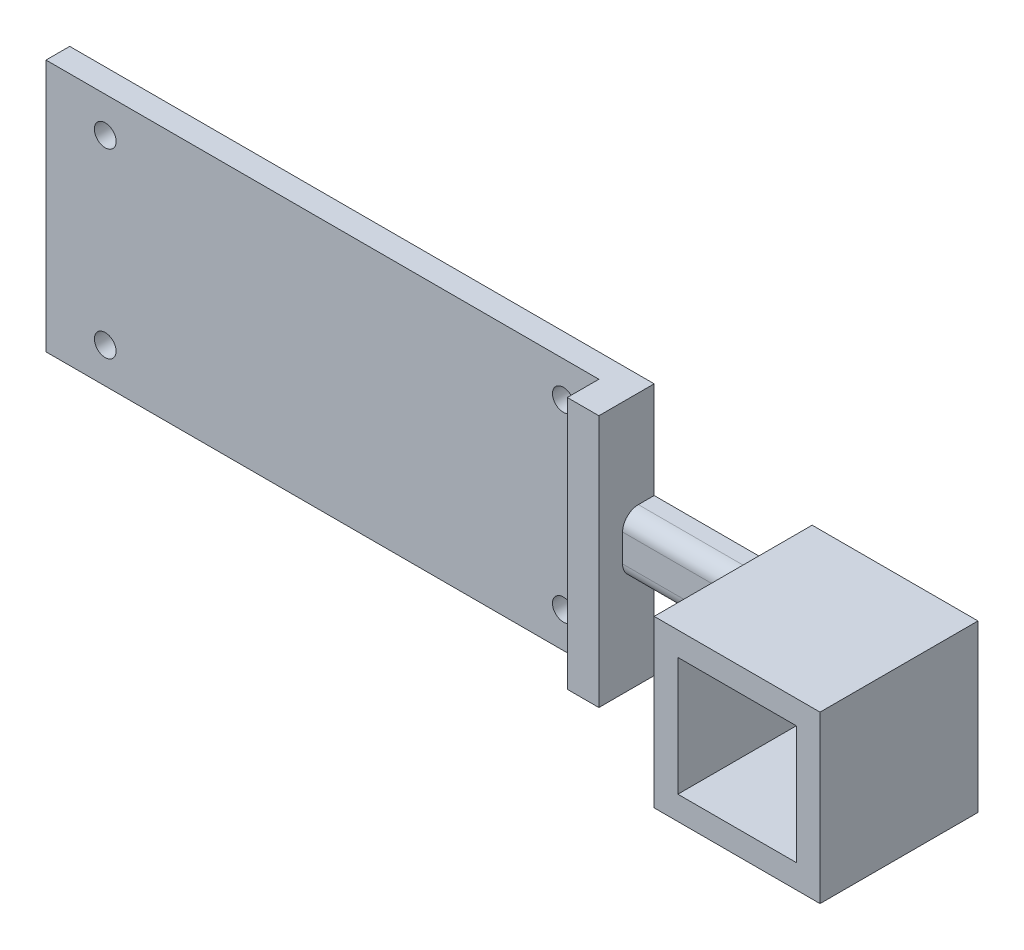
ISO-10303-21;
HEADER;
FILE_DESCRIPTION(('STEP AP214'),'2;1');
FILE_NAME('part.step','',(''),(''),'','','');
FILE_SCHEMA(('AUTOMOTIVE_DESIGN { 1 0 10303 214 1 1 1 1 }'));
ENDSEC;
DATA;
#1=APPLICATION_CONTEXT('core data for automotive mechanical design processes');
#2=APPLICATION_PROTOCOL_DEFINITION('international standard','automotive_design',2000,#1);
#3=PRODUCT_CONTEXT('',#1,'mechanical');
#4=PRODUCT('Part','Part','',(#3));
#5=PRODUCT_RELATED_PRODUCT_CATEGORY('part','',(#4));
#6=PRODUCT_DEFINITION_FORMATION('','',#4);
#7=PRODUCT_DEFINITION_CONTEXT('part definition',#1,'design');
#8=PRODUCT_DEFINITION('design','',#6,#7);
#9=PRODUCT_DEFINITION_SHAPE('','',#8);
#10=(LENGTH_UNIT() NAMED_UNIT(*) SI_UNIT(.MILLI.,.METRE.));
#11=(NAMED_UNIT(*) PLANE_ANGLE_UNIT() SI_UNIT($,.RADIAN.));
#12=(NAMED_UNIT(*) SI_UNIT($,.STERADIAN.) SOLID_ANGLE_UNIT());
#13=UNCERTAINTY_MEASURE_WITH_UNIT(LENGTH_MEASURE(1.E-05),#10,'distance_accuracy_value','');
#14=(GEOMETRIC_REPRESENTATION_CONTEXT(3) GLOBAL_UNCERTAINTY_ASSIGNED_CONTEXT((#13)) GLOBAL_UNIT_ASSIGNED_CONTEXT((#10,
#11,#12)) REPRESENTATION_CONTEXT('',''));
#15=CARTESIAN_POINT('',(0.,0.,0.));
#16=DIRECTION('',(0.,0.,1.));
#17=DIRECTION('',(1.,0.,0.));
#18=AXIS2_PLACEMENT_3D('',#15,#16,#17);
#19=CARTESIAN_POINT('',(-34.5,0.,0.));
#20=DIRECTION('',(1.,0.,0.));
#21=DIRECTION('',(0.,0.,-1.));
#22=AXIS2_PLACEMENT_3D('',#19,#20,#21);
#23=PLANE('',#22);
#24=DIRECTION('',(0.,1.,0.));
#25=VECTOR('',#24,1.);
#26=CARTESIAN_POINT('',(-34.5,16.,3.));
#27=LINE('',#26,#25);
#28=CARTESIAN_POINT('',(-34.5,-16.,3.));
#29=VERTEX_POINT('',#28);
#30=CARTESIAN_POINT('',(-34.5,16.,3.));
#31=VERTEX_POINT('',#30);
#32=EDGE_CURVE('E48',#29,#31,#27,.T.);
#33=ORIENTED_EDGE('',*,*,#32,.F.);
#34=DIRECTION('',(0.,0.,1.));
#35=VECTOR('',#34,1.);
#36=CARTESIAN_POINT('',(-34.5,-16.,0.));
#37=LINE('',#36,#35);
#38=CARTESIAN_POINT('',(-34.5,-16.,7.));
#39=VERTEX_POINT('',#38);
#40=EDGE_CURVE('E209',#29,#39,#37,.T.);
#41=ORIENTED_EDGE('',*,*,#40,.T.);
#42=DIRECTION('',(0.,1.,0.));
#43=VECTOR('',#42,1.);
#44=CARTESIAN_POINT('',(-34.5,-16.,7.));
#45=LINE('',#44,#43);
#46=CARTESIAN_POINT('',(-34.5,16.,7.));
#47=VERTEX_POINT('',#46);
#48=EDGE_CURVE('E211',#39,#47,#45,.T.);
#49=ORIENTED_EDGE('',*,*,#48,.T.);
#50=DIRECTION('',(0.,0.,-1.));
#51=VECTOR('',#50,1.);
#52=CARTESIAN_POINT('',(-34.5,16.,0.));
#53=LINE('',#52,#51);
#54=EDGE_CURVE('E214',#47,#31,#53,.T.);
#55=ORIENTED_EDGE('',*,*,#54,.T.);
#56=EDGE_LOOP('',(#33,#41,#49,#55));
#57=FACE_BOUND('',#56,.T.);
#58=ADVANCED_FACE('F33',(#57),#23,.F.);
#59=CARTESIAN_POINT('',(-10.5,-10.5,20.));
#60=DIRECTION('',(1.,0.,0.));
#61=DIRECTION('',(0.,0.,-1.));
#62=AXIS2_PLACEMENT_3D('',#59,#60,#61);
#63=PLANE('',#62);
#64=DIRECTION('',(0.,0.,-1.));
#65=VECTOR('',#64,1.);
#66=CARTESIAN_POINT('',(-10.5,3.75,0.));
#67=LINE('',#66,#65);
#68=CARTESIAN_POINT('',(-10.5,3.75,2.));
#69=VERTEX_POINT('',#68);
#70=CARTESIAN_POINT('',(-10.5,3.75,0.));
#71=VERTEX_POINT('',#70);
#72=EDGE_CURVE('E235',#69,#71,#67,.T.);
#73=ORIENTED_EDGE('',*,*,#72,.F.);
#74=CARTESIAN_POINT('',(-10.5,1.75000000000001,2.));
#75=DIRECTION('',(1.,0.,0.));
#76=DIRECTION('',(0.,0.,-1.));
#77=AXIS2_PLACEMENT_3D('',#74,#75,#76);
#78=CIRCLE('',#77,2.);
#79=CARTESIAN_POINT('',(-10.5,1.75000000000001,4.));
#80=VERTEX_POINT('',#79);
#81=EDGE_CURVE('E11',#69,#80,#78,.T.);
#82=ORIENTED_EDGE('',*,*,#81,.T.);
#83=DIRECTION('',(0.,1.,0.));
#84=VECTOR('',#83,1.);
#85=CARTESIAN_POINT('',(-10.5,3.75000000000001,4.));
#86=LINE('',#85,#84);
#87=CARTESIAN_POINT('',(-10.5,-1.74999999999999,4.));
#88=VERTEX_POINT('',#87);
#89=EDGE_CURVE('E244',#88,#80,#86,.T.);
#90=ORIENTED_EDGE('',*,*,#89,.F.);
#91=CARTESIAN_POINT('',(-10.5,-1.74999999999999,2.));
#92=DIRECTION('',(1.,0.,0.));
#93=DIRECTION('',(0.,0.,-1.));
#94=AXIS2_PLACEMENT_3D('',#91,#92,#93);
#95=CIRCLE('',#94,2.);
#96=CARTESIAN_POINT('',(-10.5,-3.74999999999999,2.));
#97=VERTEX_POINT('',#96);
#98=EDGE_CURVE('E41',#88,#97,#95,.T.);
#99=ORIENTED_EDGE('',*,*,#98,.T.);
#100=DIRECTION('',(0.,0.,1.));
#101=VECTOR('',#100,1.);
#102=CARTESIAN_POINT('',(-10.5,-3.74999999999999,0.));
#103=LINE('',#102,#101);
#104=CARTESIAN_POINT('',(-10.5,-3.74999999999999,0.));
#105=VERTEX_POINT('',#104);
#106=EDGE_CURVE('E181',#105,#97,#103,.T.);
#107=ORIENTED_EDGE('',*,*,#106,.F.);
#108=DIRECTION('',(0.,-1.,0.));
#109=VECTOR('',#108,1.);
#110=CARTESIAN_POINT('',(-10.5,-10.5,0.));
#111=LINE('',#110,#109);
#112=CARTESIAN_POINT('',(-10.5,-10.5,0.));
#113=VERTEX_POINT('',#112);
#114=EDGE_CURVE('E279',#105,#113,#111,.T.);
#115=ORIENTED_EDGE('',*,*,#114,.T.);
#116=DIRECTION('',(0.,0.,-1.));
#117=VECTOR('',#116,1.);
#118=CARTESIAN_POINT('',(-10.5,-10.5,20.));
#119=LINE('',#118,#117);
#120=CARTESIAN_POINT('',(-10.5,-10.5,20.));
#121=VERTEX_POINT('',#120);
#122=EDGE_CURVE('E313',#121,#113,#119,.T.);
#123=ORIENTED_EDGE('',*,*,#122,.F.);
#124=DIRECTION('',(0.,-1.,0.));
#125=VECTOR('',#124,1.);
#126=CARTESIAN_POINT('',(-10.5,-10.5,20.));
#127=LINE('',#126,#125);
#128=CARTESIAN_POINT('',(-10.5,10.5,20.));
#129=VERTEX_POINT('',#128);
#130=EDGE_CURVE('E286',#129,#121,#127,.T.);
#131=ORIENTED_EDGE('',*,*,#130,.F.);
#132=DIRECTION('',(0.,0.,-1.));
#133=VECTOR('',#132,1.);
#134=CARTESIAN_POINT('',(-10.5,10.5,20.));
#135=LINE('',#134,#133);
#136=CARTESIAN_POINT('',(-10.5,10.5,0.));
#137=VERTEX_POINT('',#136);
#138=EDGE_CURVE('E296',#129,#137,#135,.T.);
#139=ORIENTED_EDGE('',*,*,#138,.T.);
#140=EDGE_CURVE('E297',#137,#71,#111,.T.);
#141=ORIENTED_EDGE('',*,*,#140,.T.);
#142=EDGE_LOOP('',(#73,#82,#90,#99,#107,#115,#123,#131,#139,#141));
#143=FACE_BOUND('',#142,.T.);
#144=ADVANCED_FACE('F333',(#143),#63,.F.);
#145=CARTESIAN_POINT('',(10.5,-10.5,20.));
#146=DIRECTION('',(0.,1.,0.));
#147=DIRECTION('',(-1.,0.,0.));
#148=AXIS2_PLACEMENT_3D('',#145,#146,#147);
#149=PLANE('',#148);
#150=DIRECTION('',(1.,0.,0.));
#151=VECTOR('',#150,1.);
#152=CARTESIAN_POINT('',(10.5,-10.5,0.));
#153=LINE('',#152,#151);
#154=CARTESIAN_POINT('',(10.5,-10.5,0.));
#155=VERTEX_POINT('',#154);
#156=EDGE_CURVE('E300',#113,#155,#153,.T.);
#157=ORIENTED_EDGE('',*,*,#156,.T.);
#158=DIRECTION('',(0.,0.,-1.));
#159=VECTOR('',#158,1.);
#160=CARTESIAN_POINT('',(10.5,-10.5,20.));
#161=LINE('',#160,#159);
#162=CARTESIAN_POINT('',(10.5,-10.5,20.));
#163=VERTEX_POINT('',#162);
#164=EDGE_CURVE('E310',#163,#155,#161,.T.);
#165=ORIENTED_EDGE('',*,*,#164,.F.);
#166=DIRECTION('',(1.,0.,0.));
#167=VECTOR('',#166,1.);
#168=CARTESIAN_POINT('',(10.5,-10.5,20.));
#169=LINE('',#168,#167);
#170=EDGE_CURVE('E289',#121,#163,#169,.T.);
#171=ORIENTED_EDGE('',*,*,#170,.F.);
#172=ORIENTED_EDGE('',*,*,#122,.T.);
#173=EDGE_LOOP('',(#157,#165,#171,#172));
#174=FACE_BOUND('',#173,.T.);
#175=ADVANCED_FACE('F349',(#174),#149,.F.);
#176=CARTESIAN_POINT('',(10.5,-10.5,20.));
#177=DIRECTION('',(-1.,0.,0.));
#178=DIRECTION('',(0.,0.,1.));
#179=AXIS2_PLACEMENT_3D('',#176,#177,#178);
#180=PLANE('',#179);
#181=DIRECTION('',(0.,1.,0.));
#182=VECTOR('',#181,1.);
#183=CARTESIAN_POINT('',(10.5,-10.5,0.));
#184=LINE('',#183,#182);
#185=CARTESIAN_POINT('',(10.5,10.5,0.));
#186=VERTEX_POINT('',#185);
#187=EDGE_CURVE('E302',#155,#186,#184,.T.);
#188=ORIENTED_EDGE('',*,*,#187,.T.);
#189=DIRECTION('',(0.,0.,-1.));
#190=VECTOR('',#189,1.);
#191=CARTESIAN_POINT('',(10.5,10.5,20.));
#192=LINE('',#191,#190);
#193=CARTESIAN_POINT('',(10.5,10.5,20.));
#194=VERTEX_POINT('',#193);
#195=EDGE_CURVE('E307',#194,#186,#192,.T.);
#196=ORIENTED_EDGE('',*,*,#195,.F.);
#197=DIRECTION('',(0.,1.,0.));
#198=VECTOR('',#197,1.);
#199=CARTESIAN_POINT('',(10.5,-10.5,20.));
#200=LINE('',#199,#198);
#201=EDGE_CURVE('E292',#163,#194,#200,.T.);
#202=ORIENTED_EDGE('',*,*,#201,.F.);
#203=ORIENTED_EDGE('',*,*,#164,.T.);
#204=EDGE_LOOP('',(#188,#196,#202,#203));
#205=FACE_BOUND('',#204,.T.);
#206=ADVANCED_FACE('F410',(#205),#180,.F.);
#207=CARTESIAN_POINT('',(10.5,10.5,20.));
#208=DIRECTION('',(0.,-1.,0.));
#209=DIRECTION('',(1.,0.,0.));
#210=AXIS2_PLACEMENT_3D('',#207,#208,#209);
#211=PLANE('',#210);
#212=DIRECTION('',(-1.,0.,0.));
#213=VECTOR('',#212,1.);
#214=CARTESIAN_POINT('',(10.5,10.5,0.));
#215=LINE('',#214,#213);
#216=EDGE_CURVE('E290',#186,#137,#215,.T.);
#217=ORIENTED_EDGE('',*,*,#216,.T.);
#218=ORIENTED_EDGE('',*,*,#138,.F.);
#219=DIRECTION('',(-1.,0.,0.));
#220=VECTOR('',#219,1.);
#221=CARTESIAN_POINT('',(10.5,10.5,20.));
#222=LINE('',#221,#220);
#223=EDGE_CURVE('E294',#194,#129,#222,.T.);
#224=ORIENTED_EDGE('',*,*,#223,.F.);
#225=ORIENTED_EDGE('',*,*,#195,.T.);
#226=EDGE_LOOP('',(#217,#218,#224,#225));
#227=FACE_BOUND('',#226,.T.);
#228=ADVANCED_FACE('F358',(#227),#211,.F.);
#229=CARTESIAN_POINT('',(0.,0.,20.));
#230=DIRECTION('',(0.,0.,1.));
#231=DIRECTION('',(1.,0.,0.));
#232=AXIS2_PLACEMENT_3D('',#229,#230,#231);
#233=PLANE('',#232);
#234=DIRECTION('',(0.,-1.,0.));
#235=VECTOR('',#234,1.);
#236=CARTESIAN_POINT('',(-7.5,-7.5,20.));
#237=LINE('',#236,#235);
#238=CARTESIAN_POINT('',(-7.5,7.5,20.));
#239=VERTEX_POINT('',#238);
#240=CARTESIAN_POINT('',(-7.5,-7.5,20.));
#241=VERTEX_POINT('',#240);
#242=EDGE_CURVE('E253',#239,#241,#237,.T.);
#243=ORIENTED_EDGE('',*,*,#242,.F.);
#244=DIRECTION('',(-1.,0.,0.));
#245=VECTOR('',#244,1.);
#246=CARTESIAN_POINT('',(7.5,7.5,20.));
#247=LINE('',#246,#245);
#248=CARTESIAN_POINT('',(7.5,7.5,20.));
#249=VERTEX_POINT('',#248);
#250=EDGE_CURVE('E258',#249,#239,#247,.T.);
#251=ORIENTED_EDGE('',*,*,#250,.F.);
#252=DIRECTION('',(0.,1.,0.));
#253=VECTOR('',#252,1.);
#254=CARTESIAN_POINT('',(7.5,-7.5,20.));
#255=LINE('',#254,#253);
#256=CARTESIAN_POINT('',(7.5,-7.5,20.));
#257=VERTEX_POINT('',#256);
#258=EDGE_CURVE('E272',#257,#249,#255,.T.);
#259=ORIENTED_EDGE('',*,*,#258,.F.);
#260=DIRECTION('',(1.,0.,0.));
#261=VECTOR('',#260,1.);
#262=CARTESIAN_POINT('',(7.5,-7.5,20.));
#263=LINE('',#262,#261);
#264=EDGE_CURVE('E269',#241,#257,#263,.T.);
#265=ORIENTED_EDGE('',*,*,#264,.F.);
#266=EDGE_LOOP('',(#243,#251,#259,#265));
#267=FACE_BOUND('',#266,.T.);
#268=ORIENTED_EDGE('',*,*,#130,.T.);
#269=ORIENTED_EDGE('',*,*,#170,.T.);
#270=ORIENTED_EDGE('',*,*,#201,.T.);
#271=ORIENTED_EDGE('',*,*,#223,.T.);
#272=EDGE_LOOP('',(#268,#269,#270,#271));
#273=FACE_BOUND('',#272,.T.);
#274=ADVANCED_FACE('F353',(#267,#273),#233,.T.);
#275=CARTESIAN_POINT('',(0.,0.,0.));
#276=DIRECTION('',(0.,0.,1.));
#277=DIRECTION('',(1.,0.,0.));
#278=AXIS2_PLACEMENT_3D('',#275,#276,#277);
#279=PLANE('',#278);
#280=CARTESIAN_POINT('',(-39.,11.5,0.));
#281=DIRECTION('',(0.,0.,1.));
#282=DIRECTION('',(1.,0.,0.));
#283=AXIS2_PLACEMENT_3D('',#280,#281,#282);
#284=CIRCLE('',#283,1.375);
#285=CARTESIAN_POINT('',(-37.625,11.5,0.));
#286=VERTEX_POINT('',#285);
#287=EDGE_CURVE('E198',#286,#286,#284,.T.);
#288=ORIENTED_EDGE('',*,*,#287,.T.);
#289=EDGE_LOOP('',(#288));
#290=FACE_BOUND('',#289,.T.);
#291=CARTESIAN_POINT('',(-97.,-11.5,0.));
#292=DIRECTION('',(0.,0.,1.));
#293=DIRECTION('',(1.,0.,0.));
#294=AXIS2_PLACEMENT_3D('',#291,#292,#293);
#295=CIRCLE('',#294,1.375);
#296=CARTESIAN_POINT('',(-95.625,-11.5,0.));
#297=VERTEX_POINT('',#296);
#298=EDGE_CURVE('E593',#297,#297,#295,.T.);
#299=ORIENTED_EDGE('',*,*,#298,.T.);
#300=EDGE_LOOP('',(#299));
#301=FACE_BOUND('',#300,.T.);
#302=CARTESIAN_POINT('',(-97.,11.5,0.));
#303=DIRECTION('',(0.,0.,1.));
#304=DIRECTION('',(1.,0.,0.));
#305=AXIS2_PLACEMENT_3D('',#302,#303,#304);
#306=CIRCLE('',#305,1.375);
#307=CARTESIAN_POINT('',(-95.625,11.5,0.));
#308=VERTEX_POINT('',#307);
#309=EDGE_CURVE('E595',#308,#308,#306,.T.);
#310=ORIENTED_EDGE('',*,*,#309,.T.);
#311=EDGE_LOOP('',(#310));
#312=FACE_BOUND('',#311,.T.);
#313=CARTESIAN_POINT('',(-39.,-11.5,0.));
#314=DIRECTION('',(0.,0.,1.));
#315=DIRECTION('',(1.,0.,0.));
#316=AXIS2_PLACEMENT_3D('',#313,#314,#315);
#317=CIRCLE('',#316,1.375);
#318=CARTESIAN_POINT('',(-37.625,-11.5,0.));
#319=VERTEX_POINT('',#318);
#320=EDGE_CURVE('E599',#319,#319,#317,.T.);
#321=ORIENTED_EDGE('',*,*,#320,.T.);
#322=EDGE_LOOP('',(#321));
#323=FACE_BOUND('',#322,.T.);
#324=DIRECTION('',(-1.,0.,0.));
#325=VECTOR('',#324,1.);
#326=CARTESIAN_POINT('',(7.5,7.5,0.));
#327=LINE('',#326,#325);
#328=CARTESIAN_POINT('',(7.5,7.5,0.));
#329=VERTEX_POINT('',#328);
#330=CARTESIAN_POINT('',(-7.5,7.5,0.));
#331=VERTEX_POINT('',#330);
#332=EDGE_CURVE('E264',#329,#331,#327,.T.);
#333=ORIENTED_EDGE('',*,*,#332,.T.);
#334=DIRECTION('',(0.,-1.,0.));
#335=VECTOR('',#334,1.);
#336=CARTESIAN_POINT('',(-7.5,-7.5,0.));
#337=LINE('',#336,#335);
#338=CARTESIAN_POINT('',(-7.5,-7.5,0.));
#339=VERTEX_POINT('',#338);
#340=EDGE_CURVE('E254',#331,#339,#337,.T.);
#341=ORIENTED_EDGE('',*,*,#340,.T.);
#342=DIRECTION('',(1.,0.,0.));
#343=VECTOR('',#342,1.);
#344=CARTESIAN_POINT('',(7.5,-7.5,0.));
#345=LINE('',#344,#343);
#346=CARTESIAN_POINT('',(7.5,-7.5,0.));
#347=VERTEX_POINT('',#346);
#348=EDGE_CURVE('E257',#339,#347,#345,.T.);
#349=ORIENTED_EDGE('',*,*,#348,.T.);
#350=DIRECTION('',(0.,1.,0.));
#351=VECTOR('',#350,1.);
#352=CARTESIAN_POINT('',(7.5,-7.5,0.));
#353=LINE('',#352,#351);
#354=EDGE_CURVE('E261',#347,#329,#353,.T.);
#355=ORIENTED_EDGE('',*,*,#354,.T.);
#356=EDGE_LOOP('',(#333,#341,#349,#355));
#357=FACE_BOUND('',#356,.T.);
#358=ORIENTED_EDGE('',*,*,#140,.F.);
#359=ORIENTED_EDGE('',*,*,#216,.F.);
#360=ORIENTED_EDGE('',*,*,#187,.F.);
#361=ORIENTED_EDGE('',*,*,#156,.F.);
#362=ORIENTED_EDGE('',*,*,#114,.F.);
#363=DIRECTION('',(1.,0.,0.));
#364=VECTOR('',#363,1.);
#365=CARTESIAN_POINT('',(-30.5,-3.74999999999999,0.));
#366=LINE('',#365,#364);
#367=CARTESIAN_POINT('',(-30.5,-3.74999999999999,0.));
#368=VERTEX_POINT('',#367);
#369=EDGE_CURVE('E250',#368,#105,#366,.T.);
#370=ORIENTED_EDGE('',*,*,#369,.F.);
#371=DIRECTION('',(0.,-1.,0.));
#372=VECTOR('',#371,1.);
#373=CARTESIAN_POINT('',(-30.5,-16.,0.));
#374=LINE('',#373,#372);
#375=CARTESIAN_POINT('',(-30.5,-16.,0.));
#376=VERTEX_POINT('',#375);
#377=EDGE_CURVE('E178',#368,#376,#374,.T.);
#378=ORIENTED_EDGE('',*,*,#377,.T.);
#379=DIRECTION('',(1.,0.,0.));
#380=VECTOR('',#379,1.);
#381=CARTESIAN_POINT('',(-34.5,-16.,0.));
#382=LINE('',#381,#380);
#383=CARTESIAN_POINT('',(-104.5,-16.,0.));
#384=VERTEX_POINT('',#383);
#385=EDGE_CURVE('E169',#384,#376,#382,.T.);
#386=ORIENTED_EDGE('',*,*,#385,.F.);
#387=DIRECTION('',(0.,-1.,0.));
#388=VECTOR('',#387,1.);
#389=CARTESIAN_POINT('',(-104.5,16.,0.));
#390=LINE('',#389,#388);
#391=CARTESIAN_POINT('',(-104.5,16.,0.));
#392=VERTEX_POINT('',#391);
#393=EDGE_CURVE('E175',#392,#384,#390,.T.);
#394=ORIENTED_EDGE('',*,*,#393,.F.);
#395=DIRECTION('',(1.,0.,0.));
#396=VECTOR('',#395,1.);
#397=CARTESIAN_POINT('',(-34.5,16.,0.));
#398=LINE('',#397,#396);
#399=CARTESIAN_POINT('',(-30.5,16.,0.));
#400=VERTEX_POINT('',#399);
#401=EDGE_CURVE('E216',#392,#400,#398,.T.);
#402=ORIENTED_EDGE('',*,*,#401,.T.);
#403=CARTESIAN_POINT('',(-30.5,3.75,0.));
#404=VERTEX_POINT('',#403);
#405=EDGE_CURVE('E217',#400,#404,#374,.T.);
#406=ORIENTED_EDGE('',*,*,#405,.T.);
#407=DIRECTION('',(1.,0.,0.));
#408=VECTOR('',#407,1.);
#409=CARTESIAN_POINT('',(-30.5,3.75,0.));
#410=LINE('',#409,#408);
#411=EDGE_CURVE('E241',#404,#71,#410,.T.);
#412=ORIENTED_EDGE('',*,*,#411,.T.);
#413=EDGE_LOOP('',(#358,#359,#360,#361,#362,#370,#378,#386,#394,#402,#406,#412));
#414=FACE_BOUND('',#413,.T.);
#415=ADVANCED_FACE('F172',(#290,#301,#312,#323,#357,#414),#279,.F.);
#416=CARTESIAN_POINT('',(-7.5,-7.5,0.));
#417=DIRECTION('',(-1.,0.,0.));
#418=DIRECTION('',(0.,0.,1.));
#419=AXIS2_PLACEMENT_3D('',#416,#417,#418);
#420=PLANE('',#419);
#421=ORIENTED_EDGE('',*,*,#242,.T.);
#422=DIRECTION('',(0.,0.,1.));
#423=VECTOR('',#422,1.);
#424=CARTESIAN_POINT('',(-7.5,-7.5,0.));
#425=LINE('',#424,#423);
#426=EDGE_CURVE('E267',#339,#241,#425,.T.);
#427=ORIENTED_EDGE('',*,*,#426,.F.);
#428=ORIENTED_EDGE('',*,*,#340,.F.);
#429=DIRECTION('',(0.,0.,1.));
#430=VECTOR('',#429,1.);
#431=CARTESIAN_POINT('',(-7.5,7.5,0.));
#432=LINE('',#431,#430);
#433=EDGE_CURVE('E277',#331,#239,#432,.T.);
#434=ORIENTED_EDGE('',*,*,#433,.T.);
#435=EDGE_LOOP('',(#421,#427,#428,#434));
#436=FACE_BOUND('',#435,.T.);
#437=ADVANCED_FACE('F417',(#436),#420,.F.);
#438=CARTESIAN_POINT('',(7.5,7.5,0.));
#439=DIRECTION('',(0.,1.,0.));
#440=DIRECTION('',(-1.,0.,0.));
#441=AXIS2_PLACEMENT_3D('',#438,#439,#440);
#442=PLANE('',#441);
#443=ORIENTED_EDGE('',*,*,#250,.T.);
#444=ORIENTED_EDGE('',*,*,#433,.F.);
#445=ORIENTED_EDGE('',*,*,#332,.F.);
#446=DIRECTION('',(0.,0.,1.));
#447=VECTOR('',#446,1.);
#448=CARTESIAN_POINT('',(7.5,7.5,0.));
#449=LINE('',#448,#447);
#450=EDGE_CURVE('E280',#329,#249,#449,.T.);
#451=ORIENTED_EDGE('',*,*,#450,.T.);
#452=EDGE_LOOP('',(#443,#444,#445,#451));
#453=FACE_BOUND('',#452,.T.);
#454=ADVANCED_FACE('F424',(#453),#442,.F.);
#455=CARTESIAN_POINT('',(7.5,-7.5,0.));
#456=DIRECTION('',(1.,0.,0.));
#457=DIRECTION('',(0.,0.,-1.));
#458=AXIS2_PLACEMENT_3D('',#455,#456,#457);
#459=PLANE('',#458);
#460=ORIENTED_EDGE('',*,*,#258,.T.);
#461=ORIENTED_EDGE('',*,*,#450,.F.);
#462=ORIENTED_EDGE('',*,*,#354,.F.);
#463=DIRECTION('',(0.,0.,1.));
#464=VECTOR('',#463,1.);
#465=CARTESIAN_POINT('',(7.5,-7.5,0.));
#466=LINE('',#465,#464);
#467=EDGE_CURVE('E282',#347,#257,#466,.T.);
#468=ORIENTED_EDGE('',*,*,#467,.T.);
#469=EDGE_LOOP('',(#460,#461,#462,#468));
#470=FACE_BOUND('',#469,.T.);
#471=ADVANCED_FACE('F428',(#470),#459,.F.);
#472=CARTESIAN_POINT('',(7.5,-7.5,0.));
#473=DIRECTION('',(0.,-1.,0.));
#474=DIRECTION('',(1.,0.,0.));
#475=AXIS2_PLACEMENT_3D('',#472,#473,#474);
#476=PLANE('',#475);
#477=ORIENTED_EDGE('',*,*,#264,.T.);
#478=ORIENTED_EDGE('',*,*,#467,.F.);
#479=ORIENTED_EDGE('',*,*,#348,.F.);
#480=ORIENTED_EDGE('',*,*,#426,.T.);
#481=EDGE_LOOP('',(#477,#478,#479,#480));
#482=FACE_BOUND('',#481,.T.);
#483=ADVANCED_FACE('F374',(#482),#476,.F.);
#484=CARTESIAN_POINT('',(-30.5,-3.74999999999999,0.));
#485=DIRECTION('',(0.,1.,0.));
#486=DIRECTION('',(0.,0.,1.));
#487=AXIS2_PLACEMENT_3D('',#484,#485,#486);
#488=PLANE('',#487);
#489=ORIENTED_EDGE('',*,*,#106,.T.);
#490=DIRECTION('',(1.,0.,0.));
#491=VECTOR('',#490,1.);
#492=CARTESIAN_POINT('',(-30.5,-3.74999999999999,2.));
#493=LINE('',#492,#491);
#494=CARTESIAN_POINT('',(-30.5,-3.74999999999999,2.));
#495=VERTEX_POINT('',#494);
#496=EDGE_CURVE('E321',#97,#495,#493,.F.);
#497=ORIENTED_EDGE('',*,*,#496,.T.);
#498=DIRECTION('',(0.,0.,1.));
#499=VECTOR('',#498,1.);
#500=CARTESIAN_POINT('',(-30.5,-3.74999999999999,0.));
#501=LINE('',#500,#499);
#502=EDGE_CURVE('E231',#368,#495,#501,.T.);
#503=ORIENTED_EDGE('',*,*,#502,.F.);
#504=ORIENTED_EDGE('',*,*,#369,.T.);
#505=EDGE_LOOP('',(#489,#497,#503,#504));
#506=FACE_BOUND('',#505,.T.);
#507=ADVANCED_FACE('F339',(#506),#488,.F.);
#508=CARTESIAN_POINT('',(-30.5,3.75000000000001,4.));
#509=DIRECTION('',(0.,0.,-1.));
#510=DIRECTION('',(0.,1.,0.));
#511=AXIS2_PLACEMENT_3D('',#508,#509,#510);
#512=PLANE('',#511);
#513=DIRECTION('',(0.,1.,0.));
#514=VECTOR('',#513,1.);
#515=CARTESIAN_POINT('',(-30.5,3.75000000000001,4.));
#516=LINE('',#515,#514);
#517=CARTESIAN_POINT('',(-30.5,-1.74999999999999,4.));
#518=VERTEX_POINT('',#517);
#519=CARTESIAN_POINT('',(-30.5,1.75000000000001,4.));
#520=VERTEX_POINT('',#519);
#521=EDGE_CURVE('E234',#518,#520,#516,.T.);
#522=ORIENTED_EDGE('',*,*,#521,.F.);
#523=DIRECTION('',(1.,0.,0.));
#524=VECTOR('',#523,1.);
#525=CARTESIAN_POINT('',(-30.5,-1.74999999999999,4.));
#526=LINE('',#525,#524);
#527=EDGE_CURVE('E318',#518,#88,#526,.T.);
#528=ORIENTED_EDGE('',*,*,#527,.T.);
#529=ORIENTED_EDGE('',*,*,#89,.T.);
#530=DIRECTION('',(1.,0.,0.));
#531=VECTOR('',#530,1.);
#532=CARTESIAN_POINT('',(-30.5,1.75000000000001,4.));
#533=LINE('',#532,#531);
#534=EDGE_CURVE('E316',#80,#520,#533,.F.);
#535=ORIENTED_EDGE('',*,*,#534,.T.);
#536=EDGE_LOOP('',(#522,#528,#529,#535));
#537=FACE_BOUND('',#536,.T.);
#538=ADVANCED_FACE('F366',(#537),#512,.F.);
#539=CARTESIAN_POINT('',(-30.5,3.75,0.));
#540=DIRECTION('',(0.,-1.,0.));
#541=DIRECTION('',(0.,0.,-1.));
#542=AXIS2_PLACEMENT_3D('',#539,#540,#541);
#543=PLANE('',#542);
#544=DIRECTION('',(0.,0.,-1.));
#545=VECTOR('',#544,1.);
#546=CARTESIAN_POINT('',(-30.5,3.75,0.));
#547=LINE('',#546,#545);
#548=CARTESIAN_POINT('',(-30.5,3.75,2.));
#549=VERTEX_POINT('',#548);
#550=EDGE_CURVE('E238',#549,#404,#547,.T.);
#551=ORIENTED_EDGE('',*,*,#550,.F.);
#552=DIRECTION('',(1.,0.,0.));
#553=VECTOR('',#552,1.);
#554=CARTESIAN_POINT('',(-30.5,3.75,2.));
#555=LINE('',#554,#553);
#556=EDGE_CURVE('E329',#549,#69,#555,.T.);
#557=ORIENTED_EDGE('',*,*,#556,.T.);
#558=ORIENTED_EDGE('',*,*,#72,.T.);
#559=ORIENTED_EDGE('',*,*,#411,.F.);
#560=EDGE_LOOP('',(#551,#557,#558,#559));
#561=FACE_BOUND('',#560,.T.);
#562=ADVANCED_FACE('F362',(#561),#543,.F.);
#563=CARTESIAN_POINT('',(-30.5,-1.74999999999999,2.));
#564=DIRECTION('',(1.,0.,0.));
#565=DIRECTION('',(0.,0.,-1.));
#566=AXIS2_PLACEMENT_3D('',#563,#564,#565);
#567=CYLINDRICAL_SURFACE('',#566,2.);
#568=CARTESIAN_POINT('',(-30.5,-1.74999999999999,2.));
#569=DIRECTION('',(-1.,0.,0.));
#570=DIRECTION('',(0.,0.,1.));
#571=AXIS2_PLACEMENT_3D('',#568,#569,#570);
#572=CIRCLE('',#571,2.);
#573=EDGE_CURVE('E326',#495,#518,#572,.T.);
#574=ORIENTED_EDGE('',*,*,#573,.F.);
#575=ORIENTED_EDGE('',*,*,#496,.F.);
#576=ORIENTED_EDGE('',*,*,#98,.F.);
#577=ORIENTED_EDGE('',*,*,#527,.F.);
#578=EDGE_LOOP('',(#574,#575,#576,#577));
#579=FACE_BOUND('',#578,.T.);
#580=ADVANCED_FACE('F341',(#579),#567,.T.);
#581=CARTESIAN_POINT('',(-30.5,1.75000000000001,2.));
#582=DIRECTION('',(1.,0.,0.));
#583=DIRECTION('',(0.,0.,-1.));
#584=AXIS2_PLACEMENT_3D('',#581,#582,#583);
#585=CYLINDRICAL_SURFACE('',#584,2.);
#586=CARTESIAN_POINT('',(-30.5,1.75000000000001,2.));
#587=DIRECTION('',(-1.,0.,0.));
#588=DIRECTION('',(0.,0.,1.));
#589=AXIS2_PLACEMENT_3D('',#586,#587,#588);
#590=CIRCLE('',#589,2.);
#591=EDGE_CURVE('E323',#520,#549,#590,.T.);
#592=ORIENTED_EDGE('',*,*,#591,.F.);
#593=ORIENTED_EDGE('',*,*,#534,.F.);
#594=ORIENTED_EDGE('',*,*,#81,.F.);
#595=ORIENTED_EDGE('',*,*,#556,.F.);
#596=EDGE_LOOP('',(#592,#593,#594,#595));
#597=FACE_BOUND('',#596,.T.);
#598=ADVANCED_FACE('F35',(#597),#585,.T.);
#599=CARTESIAN_POINT('',(-34.5,-16.,0.));
#600=DIRECTION('',(0.,1.,0.));
#601=DIRECTION('',(0.,0.,1.));
#602=AXIS2_PLACEMENT_3D('',#599,#600,#601);
#603=PLANE('',#602);
#604=DIRECTION('',(0.,0.,1.));
#605=VECTOR('',#604,1.);
#606=CARTESIAN_POINT('',(-30.5,-16.,0.));
#607=LINE('',#606,#605);
#608=CARTESIAN_POINT('',(-30.5,-16.,7.));
#609=VERTEX_POINT('',#608);
#610=EDGE_CURVE('E220',#376,#609,#607,.T.);
#611=ORIENTED_EDGE('',*,*,#610,.T.);
#612=DIRECTION('',(1.,0.,0.));
#613=VECTOR('',#612,1.);
#614=CARTESIAN_POINT('',(-34.5,-16.,7.));
#615=LINE('',#614,#613);
#616=EDGE_CURVE('E182',#39,#609,#615,.T.);
#617=ORIENTED_EDGE('',*,*,#616,.F.);
#618=ORIENTED_EDGE('',*,*,#40,.F.);
#619=DIRECTION('',(1.,0.,0.));
#620=VECTOR('',#619,1.);
#621=CARTESIAN_POINT('',(-104.5,-16.,3.));
#622=LINE('',#621,#620);
#623=CARTESIAN_POINT('',(-104.5,-16.,3.));
#624=VERTEX_POINT('',#623);
#625=EDGE_CURVE('E188',#624,#29,#622,.T.);
#626=ORIENTED_EDGE('',*,*,#625,.F.);
#627=DIRECTION('',(0.,0.,1.));
#628=VECTOR('',#627,1.);
#629=CARTESIAN_POINT('',(-104.5,-16.,0.));
#630=LINE('',#629,#628);
#631=EDGE_CURVE('E185',#384,#624,#630,.T.);
#632=ORIENTED_EDGE('',*,*,#631,.F.);
#633=ORIENTED_EDGE('',*,*,#385,.T.);
#634=EDGE_LOOP('',(#611,#617,#618,#626,#632,#633));
#635=FACE_BOUND('',#634,.T.);
#636=ADVANCED_FACE('F186',(#635),#603,.F.);
#637=CARTESIAN_POINT('',(-34.5,-16.,7.));
#638=DIRECTION('',(0.,0.,-1.));
#639=DIRECTION('',(-1.,0.,0.));
#640=AXIS2_PLACEMENT_3D('',#637,#638,#639);
#641=PLANE('',#640);
#642=DIRECTION('',(0.,1.,0.));
#643=VECTOR('',#642,1.);
#644=CARTESIAN_POINT('',(-30.5,-16.,7.));
#645=LINE('',#644,#643);
#646=CARTESIAN_POINT('',(-30.5,16.,7.));
#647=VERTEX_POINT('',#646);
#648=EDGE_CURVE('E222',#609,#647,#645,.T.);
#649=ORIENTED_EDGE('',*,*,#648,.T.);
#650=DIRECTION('',(1.,0.,0.));
#651=VECTOR('',#650,1.);
#652=CARTESIAN_POINT('',(-34.5,16.,7.));
#653=LINE('',#652,#651);
#654=EDGE_CURVE('E226',#47,#647,#653,.T.);
#655=ORIENTED_EDGE('',*,*,#654,.F.);
#656=ORIENTED_EDGE('',*,*,#48,.F.);
#657=ORIENTED_EDGE('',*,*,#616,.T.);
#658=EDGE_LOOP('',(#649,#655,#656,#657));
#659=FACE_BOUND('',#658,.T.);
#660=ADVANCED_FACE('F393',(#659),#641,.F.);
#661=CARTESIAN_POINT('',(-34.5,16.,0.));
#662=DIRECTION('',(0.,-1.,0.));
#663=DIRECTION('',(0.,0.,-1.));
#664=AXIS2_PLACEMENT_3D('',#661,#662,#663);
#665=PLANE('',#664);
#666=DIRECTION('',(0.,0.,-1.));
#667=VECTOR('',#666,1.);
#668=CARTESIAN_POINT('',(-30.5,16.,0.));
#669=LINE('',#668,#667);
#670=EDGE_CURVE('E212',#647,#400,#669,.T.);
#671=ORIENTED_EDGE('',*,*,#670,.T.);
#672=ORIENTED_EDGE('',*,*,#401,.F.);
#673=DIRECTION('',(0.,0.,-1.));
#674=VECTOR('',#673,1.);
#675=CARTESIAN_POINT('',(-104.5,16.,0.));
#676=LINE('',#675,#674);
#677=CARTESIAN_POINT('',(-104.5,16.,3.));
#678=VERTEX_POINT('',#677);
#679=EDGE_CURVE('E196',#678,#392,#676,.T.);
#680=ORIENTED_EDGE('',*,*,#679,.F.);
#681=DIRECTION('',(1.,0.,0.));
#682=VECTOR('',#681,1.);
#683=CARTESIAN_POINT('',(-104.5,16.,3.));
#684=LINE('',#683,#682);
#685=EDGE_CURVE('E204',#678,#31,#684,.T.);
#686=ORIENTED_EDGE('',*,*,#685,.T.);
#687=ORIENTED_EDGE('',*,*,#54,.F.);
#688=ORIENTED_EDGE('',*,*,#654,.T.);
#689=EDGE_LOOP('',(#671,#672,#680,#686,#687,#688));
#690=FACE_BOUND('',#689,.T.);
#691=ADVANCED_FACE('F390',(#690),#665,.F.);
#692=CARTESIAN_POINT('',(-30.5,0.,0.));
#693=DIRECTION('',(1.,0.,0.));
#694=DIRECTION('',(0.,0.,-1.));
#695=AXIS2_PLACEMENT_3D('',#692,#693,#694);
#696=PLANE('',#695);
#697=ORIENTED_EDGE('',*,*,#377,.F.);
#698=ORIENTED_EDGE('',*,*,#502,.T.);
#699=ORIENTED_EDGE('',*,*,#573,.T.);
#700=ORIENTED_EDGE('',*,*,#521,.T.);
#701=ORIENTED_EDGE('',*,*,#591,.T.);
#702=ORIENTED_EDGE('',*,*,#550,.T.);
#703=ORIENTED_EDGE('',*,*,#405,.F.);
#704=ORIENTED_EDGE('',*,*,#670,.F.);
#705=ORIENTED_EDGE('',*,*,#648,.F.);
#706=ORIENTED_EDGE('',*,*,#610,.F.);
#707=EDGE_LOOP('',(#697,#698,#699,#700,#701,#702,#703,#704,#705,#706));
#708=FACE_BOUND('',#707,.T.);
#709=ADVANCED_FACE('F343',(#708),#696,.T.);
#710=CARTESIAN_POINT('',(-104.5,16.,3.));
#711=DIRECTION('',(0.,0.,-1.));
#712=DIRECTION('',(0.,1.,0.));
#713=AXIS2_PLACEMENT_3D('',#710,#711,#712);
#714=PLANE('',#713);
#715=CARTESIAN_POINT('',(-39.,11.5,3.));
#716=DIRECTION('',(0.,0.,1.));
#717=DIRECTION('',(1.,0.,0.));
#718=AXIS2_PLACEMENT_3D('',#715,#716,#717);
#719=CIRCLE('',#718,1.375);
#720=CARTESIAN_POINT('',(-37.625,11.5,3.));
#721=VERTEX_POINT('',#720);
#722=EDGE_CURVE('E590',#721,#721,#719,.T.);
#723=ORIENTED_EDGE('',*,*,#722,.F.);
#724=EDGE_LOOP('',(#723));
#725=FACE_BOUND('',#724,.T.);
#726=CARTESIAN_POINT('',(-97.,-11.5,3.));
#727=DIRECTION('',(0.,0.,1.));
#728=DIRECTION('',(1.,0.,0.));
#729=AXIS2_PLACEMENT_3D('',#726,#727,#728);
#730=CIRCLE('',#729,1.375);
#731=CARTESIAN_POINT('',(-95.625,-11.5,3.));
#732=VERTEX_POINT('',#731);
#733=EDGE_CURVE('E607',#732,#732,#730,.T.);
#734=ORIENTED_EDGE('',*,*,#733,.F.);
#735=EDGE_LOOP('',(#734));
#736=FACE_BOUND('',#735,.T.);
#737=CARTESIAN_POINT('',(-97.,11.5,3.));
#738=DIRECTION('',(0.,0.,1.));
#739=DIRECTION('',(1.,0.,0.));
#740=AXIS2_PLACEMENT_3D('',#737,#738,#739);
#741=CIRCLE('',#740,1.375);
#742=CARTESIAN_POINT('',(-95.625,11.5,3.));
#743=VERTEX_POINT('',#742);
#744=EDGE_CURVE('E610',#743,#743,#741,.T.);
#745=ORIENTED_EDGE('',*,*,#744,.F.);
#746=EDGE_LOOP('',(#745));
#747=FACE_BOUND('',#746,.T.);
#748=CARTESIAN_POINT('',(-39.,-11.5,3.));
#749=DIRECTION('',(0.,0.,1.));
#750=DIRECTION('',(1.,0.,0.));
#751=AXIS2_PLACEMENT_3D('',#748,#749,#750);
#752=CIRCLE('',#751,1.375);
#753=CARTESIAN_POINT('',(-37.625,-11.5,3.));
#754=VERTEX_POINT('',#753);
#755=EDGE_CURVE('E604',#754,#754,#752,.T.);
#756=ORIENTED_EDGE('',*,*,#755,.F.);
#757=EDGE_LOOP('',(#756));
#758=FACE_BOUND('',#757,.T.);
#759=ORIENTED_EDGE('',*,*,#32,.T.);
#760=ORIENTED_EDGE('',*,*,#685,.F.);
#761=DIRECTION('',(0.,1.,0.));
#762=VECTOR('',#761,1.);
#763=CARTESIAN_POINT('',(-104.5,16.,3.));
#764=LINE('',#763,#762);
#765=EDGE_CURVE('E191',#624,#678,#764,.T.);
#766=ORIENTED_EDGE('',*,*,#765,.F.);
#767=ORIENTED_EDGE('',*,*,#625,.T.);
#768=EDGE_LOOP('',(#759,#760,#766,#767));
#769=FACE_BOUND('',#768,.T.);
#770=ADVANCED_FACE('F386',(#725,#736,#747,#758,#769),#714,.F.);
#771=CARTESIAN_POINT('',(-104.5,0.,0.));
#772=DIRECTION('',(-1.,0.,0.));
#773=DIRECTION('',(0.,0.,1.));
#774=AXIS2_PLACEMENT_3D('',#771,#772,#773);
#775=PLANE('',#774);
#776=ORIENTED_EDGE('',*,*,#393,.T.);
#777=ORIENTED_EDGE('',*,*,#631,.T.);
#778=ORIENTED_EDGE('',*,*,#765,.T.);
#779=ORIENTED_EDGE('',*,*,#679,.T.);
#780=EDGE_LOOP('',(#776,#777,#778,#779));
#781=FACE_BOUND('',#780,.T.);
#782=ADVANCED_FACE('F194',(#781),#775,.T.);
#783=CARTESIAN_POINT('',(-39.,-11.5,-0.999999999999998));
#784=DIRECTION('',(0.,0.,1.));
#785=DIRECTION('',(1.,0.,0.));
#786=AXIS2_PLACEMENT_3D('',#783,#784,#785);
#787=CYLINDRICAL_SURFACE('',#786,1.375);
#788=ORIENTED_EDGE('',*,*,#755,.T.);
#789=EDGE_LOOP('',(#788));
#790=FACE_BOUND('',#789,.T.);
#791=ORIENTED_EDGE('',*,*,#320,.F.);
#792=EDGE_LOOP('',(#791));
#793=FACE_BOUND('',#792,.T.);
#794=ADVANCED_FACE('F534',(#790,#793),#787,.F.);
#795=CARTESIAN_POINT('',(-97.,11.5,-0.999999999999998));
#796=DIRECTION('',(0.,0.,1.));
#797=DIRECTION('',(1.,0.,0.));
#798=AXIS2_PLACEMENT_3D('',#795,#796,#797);
#799=CYLINDRICAL_SURFACE('',#798,1.375);
#800=ORIENTED_EDGE('',*,*,#744,.T.);
#801=EDGE_LOOP('',(#800));
#802=FACE_BOUND('',#801,.T.);
#803=ORIENTED_EDGE('',*,*,#309,.F.);
#804=EDGE_LOOP('',(#803));
#805=FACE_BOUND('',#804,.T.);
#806=ADVANCED_FACE('F553',(#802,#805),#799,.F.);
#807=CARTESIAN_POINT('',(-97.,-11.5,-0.999999999999998));
#808=DIRECTION('',(0.,0.,1.));
#809=DIRECTION('',(1.,0.,0.));
#810=AXIS2_PLACEMENT_3D('',#807,#808,#809);
#811=CYLINDRICAL_SURFACE('',#810,1.375);
#812=ORIENTED_EDGE('',*,*,#733,.T.);
#813=EDGE_LOOP('',(#812));
#814=FACE_BOUND('',#813,.T.);
#815=ORIENTED_EDGE('',*,*,#298,.F.);
#816=EDGE_LOOP('',(#815));
#817=FACE_BOUND('',#816,.T.);
#818=ADVANCED_FACE('F563',(#814,#817),#811,.F.);
#819=CARTESIAN_POINT('',(-39.,11.5,-0.999999999999998));
#820=DIRECTION('',(0.,0.,1.));
#821=DIRECTION('',(1.,0.,0.));
#822=AXIS2_PLACEMENT_3D('',#819,#820,#821);
#823=CYLINDRICAL_SURFACE('',#822,1.375);
#824=ORIENTED_EDGE('',*,*,#722,.T.);
#825=EDGE_LOOP('',(#824));
#826=FACE_BOUND('',#825,.T.);
#827=ORIENTED_EDGE('',*,*,#287,.F.);
#828=EDGE_LOOP('',(#827));
#829=FACE_BOUND('',#828,.T.);
#830=ADVANCED_FACE('F573',(#826,#829),#823,.F.);
#831=CLOSED_SHELL('',(#58,#144,#175,#206,#228,#274,#415,#437,#454,#471,#483,#507,#538,#562,#580,
#598,#636,#660,#691,#709,#770,#782,#794,#806,#818,#830));
#832=MANIFOLD_SOLID_BREP('B2',#831);
#833=ADVANCED_BREP_SHAPE_REPRESENTATION('',(#18,#832),#14);
#834=SHAPE_DEFINITION_REPRESENTATION(#9,#833);
ENDSEC;
END-ISO-10303-21;
